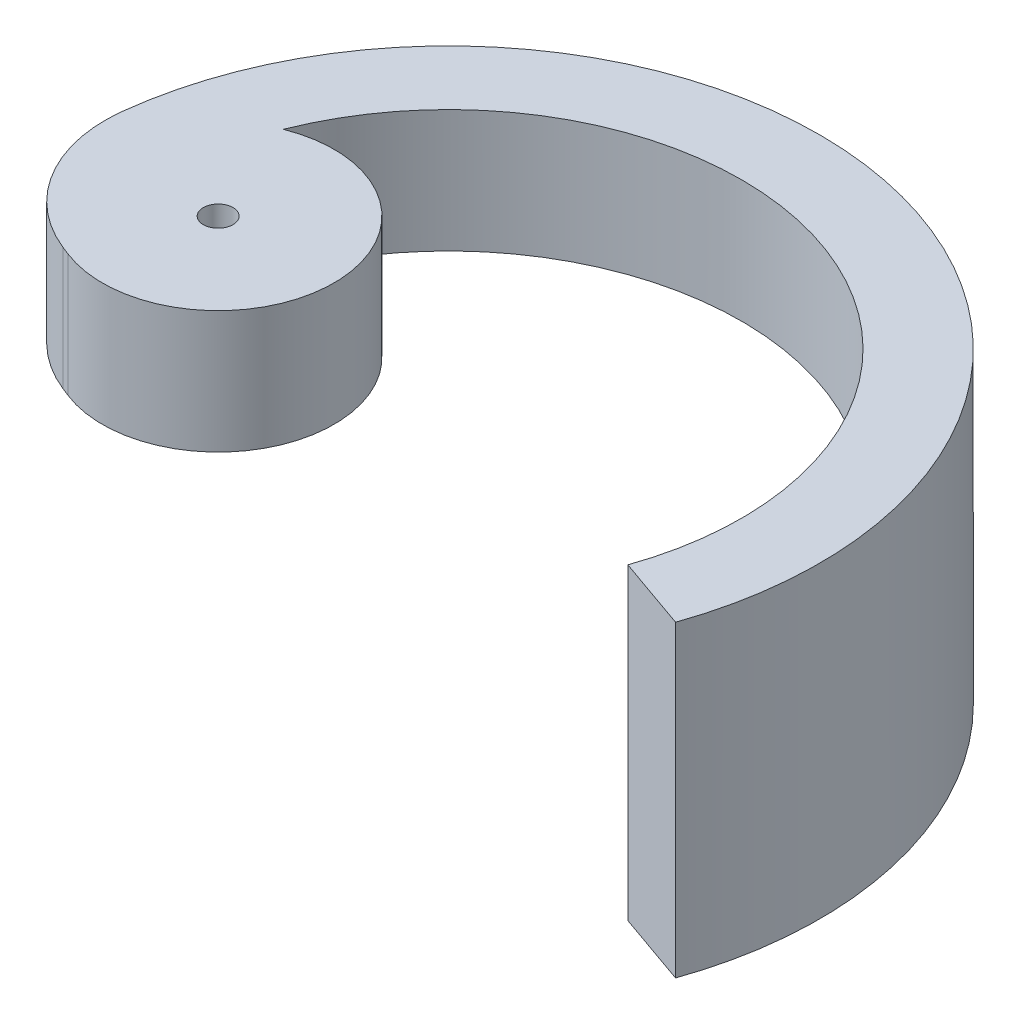
ISO-10303-21;
HEADER;
FILE_DESCRIPTION(('STEP AP214'),'2;1');
FILE_NAME('part.step','',(''),(''),'','','');
FILE_SCHEMA(('AUTOMOTIVE_DESIGN { 1 0 10303 214 1 1 1 1 }'));
ENDSEC;
DATA;
#1=APPLICATION_CONTEXT('core data for automotive mechanical design processes');
#2=APPLICATION_PROTOCOL_DEFINITION('international standard','automotive_design',2000,#1);
#3=PRODUCT_CONTEXT('',#1,'mechanical');
#4=PRODUCT('Part','Part','',(#3));
#5=PRODUCT_RELATED_PRODUCT_CATEGORY('part','',(#4));
#6=PRODUCT_DEFINITION_FORMATION('','',#4);
#7=PRODUCT_DEFINITION_CONTEXT('part definition',#1,'design');
#8=PRODUCT_DEFINITION('design','',#6,#7);
#9=PRODUCT_DEFINITION_SHAPE('','',#8);
#10=(LENGTH_UNIT() NAMED_UNIT(*) SI_UNIT(.MILLI.,.METRE.));
#11=(NAMED_UNIT(*) PLANE_ANGLE_UNIT() SI_UNIT($,.RADIAN.));
#12=(NAMED_UNIT(*) SI_UNIT($,.STERADIAN.) SOLID_ANGLE_UNIT());
#13=UNCERTAINTY_MEASURE_WITH_UNIT(LENGTH_MEASURE(1.E-05),#10,'distance_accuracy_value','');
#14=(GEOMETRIC_REPRESENTATION_CONTEXT(3) GLOBAL_UNCERTAINTY_ASSIGNED_CONTEXT((#13)) GLOBAL_UNIT_ASSIGNED_CONTEXT((#10,
#11,#12)) REPRESENTATION_CONTEXT('',''));
#15=CARTESIAN_POINT('',(0.,0.,0.));
#16=DIRECTION('',(0.,0.,1.));
#17=DIRECTION('',(1.,0.,0.));
#18=AXIS2_PLACEMENT_3D('',#15,#16,#17);
#19=CARTESIAN_POINT('',(0.,0.,0.));
#20=DIRECTION('',(0.,1.,0.));
#21=DIRECTION('',(0.,0.,1.));
#22=AXIS2_PLACEMENT_3D('',#19,#20,#21);
#23=PLANE('',#22);
#24=CARTESIAN_POINT('',(-15.748,0.,0.));
#25=DIRECTION('',(0.,1.,0.));
#26=DIRECTION('',(0.,0.,1.));
#27=AXIS2_PLACEMENT_3D('',#24,#25,#26);
#28=CIRCLE('',#27,1.016);
#29=CARTESIAN_POINT('',(-15.748,0.,1.016));
#30=VERTEX_POINT('',#29);
#31=EDGE_CURVE('E124',#30,#30,#28,.T.);
#32=ORIENTED_EDGE('',*,*,#31,.T.);
#33=EDGE_LOOP('',(#32));
#34=FACE_BOUND('',#33,.T.);
#35=DIRECTION('',(0.929928276382669,0.,0.367740942490713));
#36=VECTOR('',#35,1.);
#37=CARTESIAN_POINT('',(-18.6630031843254,0.,7.37134100024276));
#38=LINE('',#37,#36);
#39=CARTESIAN_POINT('',(-19.1926366470544,0.,7.16189698858608));
#40=VERTEX_POINT('',#39);
#41=CARTESIAN_POINT('',(-18.6630031843254,0.,7.37134100024276));
#42=VERTEX_POINT('',#41);
#43=EDGE_CURVE('E150',#40,#42,#38,.T.);
#44=ORIENTED_EDGE('',*,*,#43,.F.);
#45=CARTESIAN_POINT('',(-15.643201070134,0.,-1.81377073505945));
#46=DIRECTION('',(0.,1.,0.));
#47=DIRECTION('',(0.,0.,1.));
#48=AXIS2_PLACEMENT_3D('',#45,#46,#47);
#49=CIRCLE('',#48,9.652);
#50=CARTESIAN_POINT('',(-25.2309694679581,0.,-2.92543666945072));
#51=VERTEX_POINT('',#50);
#52=EDGE_CURVE('E54',#40,#51,#49,.F.);
#53=ORIENTED_EDGE('',*,*,#52,.T.);
#54=CARTESIAN_POINT('',(0.,0.,0.));
#55=DIRECTION('',(0.,1.,0.));
#56=DIRECTION('',(0.,0.,1.));
#57=AXIS2_PLACEMENT_3D('',#54,#55,#56);
#58=CIRCLE('',#57,25.4);
#59=CARTESIAN_POINT('',(16.8330083196543,0.,-19.0212994012094));
#60=VERTEX_POINT('',#59);
#61=EDGE_CURVE('E148',#60,#51,#58,.T.);
#62=ORIENTED_EDGE('',*,*,#61,.F.);
#63=DIRECTION('',(0.662716862978516,0.,-0.748870055165724));
#64=VECTOR('',#63,1.);
#65=CARTESIAN_POINT('',(13.2980765725269,0.,-15.0268265269554));
#66=LINE('',#65,#64);
#67=CARTESIAN_POINT('',(13.2980765725269,0.,-15.0268265269554));
#68=VERTEX_POINT('',#67);
#69=EDGE_CURVE('E117',#68,#60,#66,.T.);
#70=ORIENTED_EDGE('',*,*,#69,.F.);
#71=CARTESIAN_POINT('',(0.,0.,0.));
#72=DIRECTION('',(0.,-1.,0.));
#73=DIRECTION('',(0.,0.,1.));
#74=AXIS2_PLACEMENT_3D('',#71,#72,#73);
#75=CIRCLE('',#74,20.066);
#76=CARTESIAN_POINT('',(-18.6630031843254,0.,-7.37134100024276));
#77=VERTEX_POINT('',#76);
#78=EDGE_CURVE('E123',#77,#68,#75,.T.);
#79=ORIENTED_EDGE('',*,*,#78,.F.);
#80=CARTESIAN_POINT('',(-15.748,0.,0.));
#81=DIRECTION('',(0.,1.,0.));
#82=DIRECTION('',(0.,0.,1.));
#83=AXIS2_PLACEMENT_3D('',#80,#81,#82);
#84=CIRCLE('',#83,7.92678444935191);
#85=EDGE_CURVE('E138',#42,#77,#84,.T.);
#86=ORIENTED_EDGE('',*,*,#85,.F.);
#87=EDGE_LOOP('',(#44,#53,#62,#70,#79,#86));
#88=FACE_BOUND('',#87,.T.);
#89=ADVANCED_FACE('F32',(#34,#88),#23,.F.);
#90=CARTESIAN_POINT('',(0.,8.382,0.));
#91=DIRECTION('',(0.,1.,0.));
#92=DIRECTION('',(0.,0.,1.));
#93=AXIS2_PLACEMENT_3D('',#90,#91,#92);
#94=PLANE('',#93);
#95=CARTESIAN_POINT('',(0.,8.382,0.));
#96=DIRECTION('',(0.,1.,0.));
#97=DIRECTION('',(0.,0.,1.));
#98=AXIS2_PLACEMENT_3D('',#95,#96,#97);
#99=CIRCLE('',#98,25.4);
#100=CARTESIAN_POINT('',(23.9653004716015,8.382,8.4157217935159));
#101=VERTEX_POINT('',#100);
#102=CARTESIAN_POINT('',(-25.2309694679581,8.382,-2.92543666945072));
#103=VERTEX_POINT('',#102);
#104=EDGE_CURVE('E140',#101,#103,#99,.T.);
#105=ORIENTED_EDGE('',*,*,#104,.T.);
#106=CARTESIAN_POINT('',(-15.643201070134,8.382,-1.81377073505945));
#107=DIRECTION('',(0.,1.,0.));
#108=DIRECTION('',(0.,0.,1.));
#109=AXIS2_PLACEMENT_3D('',#106,#107,#108);
#110=CIRCLE('',#109,9.652);
#111=CARTESIAN_POINT('',(-19.1926366470544,8.382,7.16189698858608));
#112=VERTEX_POINT('',#111);
#113=EDGE_CURVE('E11',#103,#112,#110,.T.);
#114=ORIENTED_EDGE('',*,*,#113,.T.);
#115=DIRECTION('',(0.929928276382669,0.,0.367740942490713));
#116=VECTOR('',#115,1.);
#117=CARTESIAN_POINT('',(-18.6630031843254,8.382,7.37134100024276));
#118=LINE('',#117,#116);
#119=CARTESIAN_POINT('',(-18.6630031843254,8.382,7.37134100024276));
#120=VERTEX_POINT('',#119);
#121=EDGE_CURVE('E142',#112,#120,#118,.T.);
#122=ORIENTED_EDGE('',*,*,#121,.T.);
#123=CARTESIAN_POINT('',(-15.748,8.382,0.));
#124=DIRECTION('',(0.,1.,0.));
#125=DIRECTION('',(0.,0.,1.));
#126=AXIS2_PLACEMENT_3D('',#123,#124,#125);
#127=CIRCLE('',#126,7.92678444935191);
#128=CARTESIAN_POINT('',(-18.6630031843254,8.382,-7.37134100024276));
#129=VERTEX_POINT('',#128);
#130=EDGE_CURVE('E144',#120,#129,#127,.T.);
#131=ORIENTED_EDGE('',*,*,#130,.T.);
#132=CARTESIAN_POINT('',(0.,8.382,0.));
#133=DIRECTION('',(0.,-1.,0.));
#134=DIRECTION('',(0.,0.,1.));
#135=AXIS2_PLACEMENT_3D('',#132,#133,#134);
#136=CIRCLE('',#135,20.066);
#137=CARTESIAN_POINT('',(18.9325873725652,8.382,6.64842021687756));
#138=VERTEX_POINT('',#137);
#139=EDGE_CURVE('E134',#129,#138,#136,.T.);
#140=ORIENTED_EDGE('',*,*,#139,.T.);
#141=DIRECTION('',(0.943515766598483,0.,0.33132762966598));
#142=VECTOR('',#141,1.);
#143=CARTESIAN_POINT('',(18.9325873725652,8.382,6.64842021687756));
#144=LINE('',#143,#142);
#145=EDGE_CURVE('E137',#138,#101,#144,.T.);
#146=ORIENTED_EDGE('',*,*,#145,.T.);
#147=EDGE_LOOP('',(#105,#114,#122,#131,#140,#146));
#148=FACE_BOUND('',#147,.T.);
#149=CARTESIAN_POINT('',(-15.748,8.382,0.));
#150=DIRECTION('',(0.,1.,0.));
#151=DIRECTION('',(0.,0.,1.));
#152=AXIS2_PLACEMENT_3D('',#149,#150,#151);
#153=CIRCLE('',#152,1.016);
#154=CARTESIAN_POINT('',(-15.748,8.382,1.016));
#155=VERTEX_POINT('',#154);
#156=EDGE_CURVE('E127',#155,#155,#153,.T.);
#157=ORIENTED_EDGE('',*,*,#156,.F.);
#158=EDGE_LOOP('',(#157));
#159=FACE_BOUND('',#158,.T.);
#160=ADVANCED_FACE('F178',(#148,#159),#94,.T.);
#161=CARTESIAN_POINT('',(0.,8.382,0.));
#162=DIRECTION('',(0.,-1.,0.));
#163=DIRECTION('',(0.,0.,-1.));
#164=AXIS2_PLACEMENT_3D('',#161,#162,#163);
#165=CYLINDRICAL_SURFACE('',#164,20.066);
#166=ORIENTED_EDGE('',*,*,#78,.T.);
#167=DIRECTION('',(0.,1.,0.));
#168=VECTOR('',#167,1.);
#169=CARTESIAN_POINT('',(13.2980765725269,-12.7,-15.0268265269554));
#170=LINE('',#169,#168);
#171=CARTESIAN_POINT('',(13.2980765725269,-12.7,-15.0268265269554));
#172=VERTEX_POINT('',#171);
#173=EDGE_CURVE('E101',#172,#68,#170,.T.);
#174=ORIENTED_EDGE('',*,*,#173,.F.);
#175=CARTESIAN_POINT('',(0.,-12.7,0.));
#176=DIRECTION('',(0.,1.,0.));
#177=DIRECTION('',(0.,0.,-1.));
#178=AXIS2_PLACEMENT_3D('',#175,#176,#177);
#179=CIRCLE('',#178,20.066);
#180=CARTESIAN_POINT('',(18.9325873725652,-12.7,6.64842021687756));
#181=VERTEX_POINT('',#180);
#182=EDGE_CURVE('E108',#181,#172,#179,.T.);
#183=ORIENTED_EDGE('',*,*,#182,.F.);
#184=DIRECTION('',(0.,-1.,0.));
#185=VECTOR('',#184,1.);
#186=CARTESIAN_POINT('',(18.9325873725652,8.382,6.64842021687756));
#187=LINE('',#186,#185);
#188=EDGE_CURVE('E159',#138,#181,#187,.T.);
#189=ORIENTED_EDGE('',*,*,#188,.F.);
#190=ORIENTED_EDGE('',*,*,#139,.F.);
#191=DIRECTION('',(0.,-1.,0.));
#192=VECTOR('',#191,1.);
#193=CARTESIAN_POINT('',(-18.6630031843254,8.382,-7.37134100024276));
#194=LINE('',#193,#192);
#195=EDGE_CURVE('E146',#129,#77,#194,.T.);
#196=ORIENTED_EDGE('',*,*,#195,.T.);
#197=EDGE_LOOP('',(#166,#174,#183,#189,#190,#196));
#198=FACE_BOUND('',#197,.T.);
#199=ADVANCED_FACE('F120',(#198),#165,.F.);
#200=CARTESIAN_POINT('',(18.9325873725652,8.382,6.64842021687756));
#201=DIRECTION('',(0.33132762966598,0.,-0.943515766598483));
#202=DIRECTION('',(-0.943515766598483,0.,-0.33132762966598));
#203=AXIS2_PLACEMENT_3D('',#200,#201,#202);
#204=PLANE('',#203);
#205=ORIENTED_EDGE('',*,*,#188,.T.);
#206=DIRECTION('',(-0.943515766598483,0.,-0.33132762966598));
#207=VECTOR('',#206,1.);
#208=CARTESIAN_POINT('',(18.9325873725652,-12.7,6.64842021687756));
#209=LINE('',#208,#207);
#210=CARTESIAN_POINT('',(23.9653004716015,-12.7,8.4157217935159));
#211=VERTEX_POINT('',#210);
#212=EDGE_CURVE('E114',#211,#181,#209,.T.);
#213=ORIENTED_EDGE('',*,*,#212,.F.);
#214=DIRECTION('',(0.,-1.,0.));
#215=VECTOR('',#214,1.);
#216=CARTESIAN_POINT('',(23.9653004716015,8.382,8.4157217935159));
#217=LINE('',#216,#215);
#218=EDGE_CURVE('E157',#101,#211,#217,.T.);
#219=ORIENTED_EDGE('',*,*,#218,.F.);
#220=ORIENTED_EDGE('',*,*,#145,.F.);
#221=EDGE_LOOP('',(#205,#213,#219,#220));
#222=FACE_BOUND('',#221,.T.);
#223=ADVANCED_FACE('F203',(#222),#204,.F.);
#224=CARTESIAN_POINT('',(0.,8.382,0.));
#225=DIRECTION('',(0.,-1.,0.));
#226=DIRECTION('',(0.,0.,-1.));
#227=AXIS2_PLACEMENT_3D('',#224,#225,#226);
#228=CYLINDRICAL_SURFACE('',#227,25.4);
#229=ORIENTED_EDGE('',*,*,#61,.T.);
#230=DIRECTION('',(0.,-1.,0.));
#231=VECTOR('',#230,1.);
#232=CARTESIAN_POINT('',(-25.2309694679581,8.382,-2.92543666945072));
#233=LINE('',#232,#231);
#234=EDGE_CURVE('E40',#51,#103,#233,.F.);
#235=ORIENTED_EDGE('',*,*,#234,.T.);
#236=ORIENTED_EDGE('',*,*,#104,.F.);
#237=ORIENTED_EDGE('',*,*,#218,.T.);
#238=CARTESIAN_POINT('',(0.,-12.7,0.));
#239=DIRECTION('',(0.,-1.,0.));
#240=DIRECTION('',(0.,0.,-1.));
#241=AXIS2_PLACEMENT_3D('',#238,#239,#240);
#242=CIRCLE('',#241,25.4);
#243=CARTESIAN_POINT('',(16.8330083196543,-12.7,-19.0212994012094));
#244=VERTEX_POINT('',#243);
#245=EDGE_CURVE('E107',#244,#211,#242,.T.);
#246=ORIENTED_EDGE('',*,*,#245,.F.);
#247=DIRECTION('',(0.,1.,0.));
#248=VECTOR('',#247,1.);
#249=CARTESIAN_POINT('',(16.8330083196543,-12.7,-19.0212994012094));
#250=LINE('',#249,#248);
#251=EDGE_CURVE('E103',#244,#60,#250,.T.);
#252=ORIENTED_EDGE('',*,*,#251,.T.);
#253=EDGE_LOOP('',(#229,#235,#236,#237,#246,#252));
#254=FACE_BOUND('',#253,.T.);
#255=ADVANCED_FACE('F200',(#254),#228,.T.);
#256=CARTESIAN_POINT('',(-18.6630031843254,8.382,7.37134100024276));
#257=DIRECTION('',(0.367740942490713,0.,-0.929928276382669));
#258=DIRECTION('',(-0.929928276382669,0.,-0.367740942490713));
#259=AXIS2_PLACEMENT_3D('',#256,#257,#258);
#260=PLANE('',#259);
#261=ORIENTED_EDGE('',*,*,#121,.F.);
#262=DIRECTION('',(0.,-1.,0.));
#263=VECTOR('',#262,1.);
#264=CARTESIAN_POINT('',(-19.1926366470544,8.382,7.16189698858608));
#265=LINE('',#264,#263);
#266=EDGE_CURVE('E161',#112,#40,#265,.T.);
#267=ORIENTED_EDGE('',*,*,#266,.T.);
#268=ORIENTED_EDGE('',*,*,#43,.T.);
#269=DIRECTION('',(0.,-1.,0.));
#270=VECTOR('',#269,1.);
#271=CARTESIAN_POINT('',(-18.6630031843254,8.382,7.37134100024276));
#272=LINE('',#271,#270);
#273=EDGE_CURVE('E154',#120,#42,#272,.T.);
#274=ORIENTED_EDGE('',*,*,#273,.F.);
#275=EDGE_LOOP('',(#261,#267,#268,#274));
#276=FACE_BOUND('',#275,.T.);
#277=ADVANCED_FACE('F167',(#276),#260,.F.);
#278=CARTESIAN_POINT('',(-15.748,8.382,0.));
#279=DIRECTION('',(0.,-1.,0.));
#280=DIRECTION('',(0.,0.,-1.));
#281=AXIS2_PLACEMENT_3D('',#278,#279,#280);
#282=CYLINDRICAL_SURFACE('',#281,7.92678444935191);
#283=ORIENTED_EDGE('',*,*,#85,.T.);
#284=ORIENTED_EDGE('',*,*,#195,.F.);
#285=ORIENTED_EDGE('',*,*,#130,.F.);
#286=ORIENTED_EDGE('',*,*,#273,.T.);
#287=EDGE_LOOP('',(#283,#284,#285,#286));
#288=FACE_BOUND('',#287,.T.);
#289=ADVANCED_FACE('F174',(#288),#282,.T.);
#290=CARTESIAN_POINT('',(-15.748,8.382,0.));
#291=DIRECTION('',(0.,-1.,0.));
#292=DIRECTION('',(0.,0.,-1.));
#293=AXIS2_PLACEMENT_3D('',#290,#291,#292);
#294=CYLINDRICAL_SURFACE('',#293,1.016);
#295=ORIENTED_EDGE('',*,*,#156,.T.);
#296=EDGE_LOOP('',(#295));
#297=FACE_BOUND('',#296,.T.);
#298=ORIENTED_EDGE('',*,*,#31,.F.);
#299=EDGE_LOOP('',(#298));
#300=FACE_BOUND('',#299,.T.);
#301=ADVANCED_FACE('F197',(#297,#300),#294,.F.);
#302=CARTESIAN_POINT('',(13.2980765725269,-12.7,-15.0268265269554));
#303=DIRECTION('',(0.748870055165724,0.,0.662716862978516));
#304=DIRECTION('',(0.662716862978516,0.,-0.748870055165724));
#305=AXIS2_PLACEMENT_3D('',#302,#303,#304);
#306=PLANE('',#305);
#307=ORIENTED_EDGE('',*,*,#69,.T.);
#308=ORIENTED_EDGE('',*,*,#251,.F.);
#309=DIRECTION('',(0.662716862978516,0.,-0.748870055165724));
#310=VECTOR('',#309,1.);
#311=CARTESIAN_POINT('',(13.2980765725269,-12.7,-15.0268265269554));
#312=LINE('',#311,#310);
#313=EDGE_CURVE('E96',#172,#244,#312,.T.);
#314=ORIENTED_EDGE('',*,*,#313,.F.);
#315=ORIENTED_EDGE('',*,*,#173,.T.);
#316=EDGE_LOOP('',(#307,#308,#314,#315));
#317=FACE_BOUND('',#316,.T.);
#318=ADVANCED_FACE('F99',(#317),#306,.F.);
#319=CARTESIAN_POINT('',(0.,-12.7,0.));
#320=DIRECTION('',(0.,-1.,0.));
#321=DIRECTION('',(0.,0.,-1.));
#322=AXIS2_PLACEMENT_3D('',#319,#320,#321);
#323=PLANE('',#322);
#324=ORIENTED_EDGE('',*,*,#182,.T.);
#325=ORIENTED_EDGE('',*,*,#313,.T.);
#326=ORIENTED_EDGE('',*,*,#245,.T.);
#327=ORIENTED_EDGE('',*,*,#212,.T.);
#328=EDGE_LOOP('',(#324,#325,#326,#327));
#329=FACE_BOUND('',#328,.T.);
#330=ADVANCED_FACE('F112',(#329),#323,.T.);
#331=CARTESIAN_POINT('',(-15.643201070134,8.382,-1.81377073505945));
#332=DIRECTION('',(0.,-1.,0.));
#333=DIRECTION('',(0.,0.,-1.));
#334=AXIS2_PLACEMENT_3D('',#331,#332,#333);
#335=CYLINDRICAL_SURFACE('',#334,9.652);
#336=ORIENTED_EDGE('',*,*,#113,.F.);
#337=ORIENTED_EDGE('',*,*,#234,.F.);
#338=ORIENTED_EDGE('',*,*,#52,.F.);
#339=ORIENTED_EDGE('',*,*,#266,.F.);
#340=EDGE_LOOP('',(#336,#337,#338,#339));
#341=FACE_BOUND('',#340,.T.);
#342=ADVANCED_FACE('F34',(#341),#335,.T.);
#343=CLOSED_SHELL('',(#89,#160,#199,#223,#255,#277,#289,#301,#318,#330,#342));
#344=MANIFOLD_SOLID_BREP('B2',#343);
#345=ADVANCED_BREP_SHAPE_REPRESENTATION('',(#18,#344),#14);
#346=SHAPE_DEFINITION_REPRESENTATION(#9,#345);
ENDSEC;
END-ISO-10303-21;
